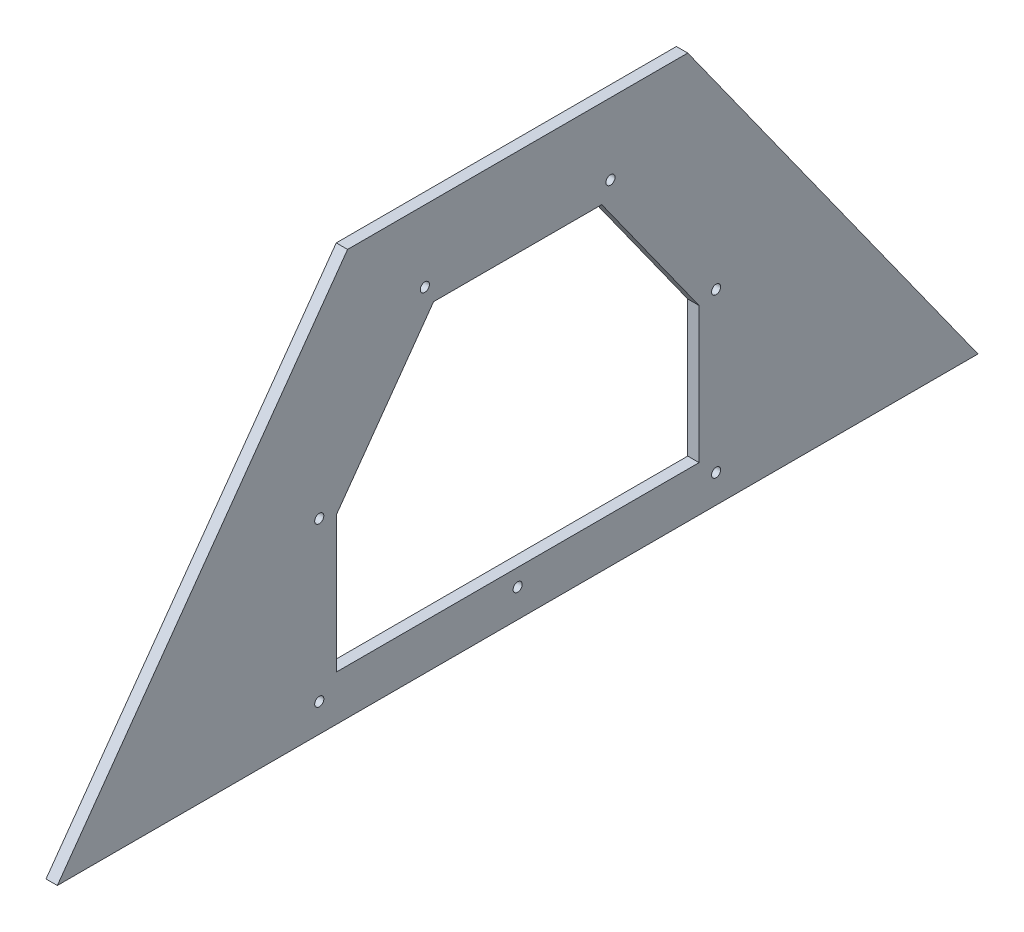
ISO-10303-21;
HEADER;
FILE_DESCRIPTION(('STEP AP214'),'2;1');
FILE_NAME('part.step','',(''),(''),'','','');
FILE_SCHEMA(('AUTOMOTIVE_DESIGN { 1 0 10303 214 1 1 1 1 }'));
ENDSEC;
DATA;
#1=APPLICATION_CONTEXT('core data for automotive mechanical design processes');
#2=APPLICATION_PROTOCOL_DEFINITION('international standard','automotive_design',2000,#1);
#3=PRODUCT_CONTEXT('',#1,'mechanical');
#4=PRODUCT('Part','Part','',(#3));
#5=PRODUCT_RELATED_PRODUCT_CATEGORY('part','',(#4));
#6=PRODUCT_DEFINITION_FORMATION('','',#4);
#7=PRODUCT_DEFINITION_CONTEXT('part definition',#1,'design');
#8=PRODUCT_DEFINITION('design','',#6,#7);
#9=PRODUCT_DEFINITION_SHAPE('','',#8);
#10=(LENGTH_UNIT() NAMED_UNIT(*) SI_UNIT(.MILLI.,.METRE.));
#11=(NAMED_UNIT(*) PLANE_ANGLE_UNIT() SI_UNIT($,.RADIAN.));
#12=(NAMED_UNIT(*) SI_UNIT($,.STERADIAN.) SOLID_ANGLE_UNIT());
#13=UNCERTAINTY_MEASURE_WITH_UNIT(LENGTH_MEASURE(1.E-05),#10,'distance_accuracy_value','');
#14=(GEOMETRIC_REPRESENTATION_CONTEXT(3) GLOBAL_UNCERTAINTY_ASSIGNED_CONTEXT((#13)) GLOBAL_UNIT_ASSIGNED_CONTEXT((#10,
#11,#12)) REPRESENTATION_CONTEXT('',''));
#15=CARTESIAN_POINT('',(0.,0.,0.));
#16=DIRECTION('',(0.,0.,1.));
#17=DIRECTION('',(1.,0.,0.));
#18=AXIS2_PLACEMENT_3D('',#15,#16,#17);
#19=CARTESIAN_POINT('',(6.35,0.,257.81));
#20=DIRECTION('',(0.,-0.581818181818182,-0.813318881685274));
#21=DIRECTION('',(0.,0.813318881685274,-0.581818181818182));
#22=AXIS2_PLACEMENT_3D('',#19,#20,#21);
#23=PLANE('',#22);
#24=DIRECTION('',(0.,-0.813318881685274,0.581818181818182));
#25=VECTOR('',#24,1.);
#26=CARTESIAN_POINT('',(0.,0.,257.81));
#27=LINE('',#26,#25);
#28=CARTESIAN_POINT('',(0.,227.241295542866,95.25));
#29=VERTEX_POINT('',#28);
#30=CARTESIAN_POINT('',(0.,0.,257.81));
#31=VERTEX_POINT('',#30);
#32=EDGE_CURVE('E160',#29,#31,#27,.T.);
#33=ORIENTED_EDGE('',*,*,#32,.T.);
#34=DIRECTION('',(-1.,0.,0.));
#35=VECTOR('',#34,1.);
#36=CARTESIAN_POINT('',(6.35,0.,257.81));
#37=LINE('',#36,#35);
#38=CARTESIAN_POINT('',(6.35,0.,257.81));
#39=VERTEX_POINT('',#38);
#40=EDGE_CURVE('E11',#39,#31,#37,.T.);
#41=ORIENTED_EDGE('',*,*,#40,.F.);
#42=DIRECTION('',(0.,-0.813318881685274,0.581818181818182));
#43=VECTOR('',#42,1.);
#44=CARTESIAN_POINT('',(6.35,0.,257.81));
#45=LINE('',#44,#43);
#46=CARTESIAN_POINT('',(6.35,227.241295542866,95.25));
#47=VERTEX_POINT('',#46);
#48=EDGE_CURVE('E168',#47,#39,#45,.T.);
#49=ORIENTED_EDGE('',*,*,#48,.F.);
#50=DIRECTION('',(-1.,0.,0.));
#51=VECTOR('',#50,1.);
#52=CARTESIAN_POINT('',(6.35,227.241295542866,95.25));
#53=LINE('',#52,#51);
#54=EDGE_CURVE('E178',#47,#29,#53,.T.);
#55=ORIENTED_EDGE('',*,*,#54,.T.);
#56=EDGE_LOOP('',(#33,#41,#49,#55));
#57=FACE_BOUND('',#56,.T.);
#58=ADVANCED_FACE('F36',(#57),#23,.F.);
#59=CARTESIAN_POINT('',(6.35,0.,-257.81));
#60=DIRECTION('',(0.,1.,0.));
#61=DIRECTION('',(0.,0.,1.));
#62=AXIS2_PLACEMENT_3D('',#59,#60,#61);
#63=PLANE('',#62);
#64=DIRECTION('',(0.,0.,-1.));
#65=VECTOR('',#64,1.);
#66=CARTESIAN_POINT('',(0.,0.,-257.81));
#67=LINE('',#66,#65);
#68=CARTESIAN_POINT('',(0.,0.,-257.81));
#69=VERTEX_POINT('',#68);
#70=EDGE_CURVE('E181',#31,#69,#67,.T.);
#71=ORIENTED_EDGE('',*,*,#70,.T.);
#72=DIRECTION('',(-1.,0.,0.));
#73=VECTOR('',#72,1.);
#74=CARTESIAN_POINT('',(6.35,0.,-257.81));
#75=LINE('',#74,#73);
#76=CARTESIAN_POINT('',(6.35,0.,-257.81));
#77=VERTEX_POINT('',#76);
#78=EDGE_CURVE('E43',#77,#69,#75,.T.);
#79=ORIENTED_EDGE('',*,*,#78,.F.);
#80=DIRECTION('',(0.,0.,-1.));
#81=VECTOR('',#80,1.);
#82=CARTESIAN_POINT('',(6.35,0.,-257.81));
#83=LINE('',#82,#81);
#84=EDGE_CURVE('E171',#39,#77,#83,.T.);
#85=ORIENTED_EDGE('',*,*,#84,.F.);
#86=ORIENTED_EDGE('',*,*,#40,.T.);
#87=EDGE_LOOP('',(#71,#79,#85,#86));
#88=FACE_BOUND('',#87,.T.);
#89=ADVANCED_FACE('F209',(#88),#63,.F.);
#90=CARTESIAN_POINT('',(6.35,0.,-257.81));
#91=DIRECTION('',(0.,-0.581818181818182,0.813318881685274));
#92=DIRECTION('',(0.,-0.813318881685274,-0.581818181818182));
#93=AXIS2_PLACEMENT_3D('',#90,#91,#92);
#94=PLANE('',#93);
#95=DIRECTION('',(0.,0.813318881685274,0.581818181818182));
#96=VECTOR('',#95,1.);
#97=CARTESIAN_POINT('',(0.,0.,-257.81));
#98=LINE('',#97,#96);
#99=CARTESIAN_POINT('',(0.,227.241295542866,-95.25));
#100=VERTEX_POINT('',#99);
#101=EDGE_CURVE('E183',#69,#100,#98,.T.);
#102=ORIENTED_EDGE('',*,*,#101,.T.);
#103=DIRECTION('',(-1.,0.,0.));
#104=VECTOR('',#103,1.);
#105=CARTESIAN_POINT('',(6.35,227.241295542866,-95.25));
#106=LINE('',#105,#104);
#107=CARTESIAN_POINT('',(6.35,227.241295542866,-95.25));
#108=VERTEX_POINT('',#107);
#109=EDGE_CURVE('E188',#108,#100,#106,.T.);
#110=ORIENTED_EDGE('',*,*,#109,.F.);
#111=DIRECTION('',(0.,0.813318881685274,0.581818181818182));
#112=VECTOR('',#111,1.);
#113=CARTESIAN_POINT('',(6.35,0.,-257.81));
#114=LINE('',#113,#112);
#115=EDGE_CURVE('E174',#77,#108,#114,.T.);
#116=ORIENTED_EDGE('',*,*,#115,.F.);
#117=ORIENTED_EDGE('',*,*,#78,.T.);
#118=EDGE_LOOP('',(#102,#110,#116,#117));
#119=FACE_BOUND('',#118,.T.);
#120=ADVANCED_FACE('F195',(#119),#94,.F.);
#121=CARTESIAN_POINT('',(6.35,227.241295542866,95.25));
#122=DIRECTION('',(0.,-1.,0.));
#123=DIRECTION('',(0.,0.,-1.));
#124=AXIS2_PLACEMENT_3D('',#121,#122,#123);
#125=PLANE('',#124);
#126=DIRECTION('',(0.,0.,1.));
#127=VECTOR('',#126,1.);
#128=CARTESIAN_POINT('',(0.,227.241295542866,95.25));
#129=LINE('',#128,#127);
#130=EDGE_CURVE('E172',#100,#29,#129,.T.);
#131=ORIENTED_EDGE('',*,*,#130,.T.);
#132=ORIENTED_EDGE('',*,*,#54,.F.);
#133=DIRECTION('',(0.,0.,1.));
#134=VECTOR('',#133,1.);
#135=CARTESIAN_POINT('',(6.35,227.241295542866,95.25));
#136=LINE('',#135,#134);
#137=EDGE_CURVE('E176',#108,#47,#136,.T.);
#138=ORIENTED_EDGE('',*,*,#137,.F.);
#139=ORIENTED_EDGE('',*,*,#109,.T.);
#140=EDGE_LOOP('',(#131,#132,#138,#139));
#141=FACE_BOUND('',#140,.T.);
#142=ADVANCED_FACE('F202',(#141),#125,.F.);
#143=CARTESIAN_POINT('',(6.35,0.,0.));
#144=DIRECTION('',(1.,0.,0.));
#145=DIRECTION('',(0.,0.,-1.));
#146=AXIS2_PLACEMENT_3D('',#143,#144,#145);
#147=PLANE('',#146);
#148=CARTESIAN_POINT('',(6.35,187.325,-51.9867861117994));
#149=DIRECTION('',(1.,0.,0.));
#150=DIRECTION('',(0.,0.,-1.));
#151=AXIS2_PLACEMENT_3D('',#148,#149,#150);
#152=CIRCLE('',#151,2.55269999999999);
#153=CARTESIAN_POINT('',(6.35,187.325,-54.5394861117994));
#154=VERTEX_POINT('',#153);
#155=EDGE_CURVE('E279',#154,#154,#152,.T.);
#156=ORIENTED_EDGE('',*,*,#155,.F.);
#157=EDGE_LOOP('',(#156));
#158=FACE_BOUND('',#157,.T.);
#159=CARTESIAN_POINT('',(6.35,187.325,51.9867861117994));
#160=DIRECTION('',(1.,0.,0.));
#161=DIRECTION('',(0.,0.,-1.));
#162=AXIS2_PLACEMENT_3D('',#159,#160,#161);
#163=CIRCLE('',#162,2.55269999999999);
#164=CARTESIAN_POINT('',(6.35,187.325,49.4340861117994));
#165=VERTEX_POINT('',#164);
#166=EDGE_CURVE('E281',#165,#165,#163,.T.);
#167=ORIENTED_EDGE('',*,*,#166,.F.);
#168=EDGE_LOOP('',(#167));
#169=FACE_BOUND('',#168,.T.);
#170=CARTESIAN_POINT('',(6.35,104.656174089285,-111.125));
#171=DIRECTION('',(1.,0.,0.));
#172=DIRECTION('',(0.,0.,-1.));
#173=AXIS2_PLACEMENT_3D('',#170,#171,#172);
#174=CIRCLE('',#173,2.55270000000001);
#175=CARTESIAN_POINT('',(6.35,104.656174089285,-113.6777));
#176=VERTEX_POINT('',#175);
#177=EDGE_CURVE('E289',#176,#176,#174,.T.);
#178=ORIENTED_EDGE('',*,*,#177,.F.);
#179=EDGE_LOOP('',(#178));
#180=FACE_BOUND('',#179,.T.);
#181=CARTESIAN_POINT('',(6.35,15.8749999999999,-111.125));
#182=DIRECTION('',(1.,0.,0.));
#183=DIRECTION('',(0.,0.,-1.));
#184=AXIS2_PLACEMENT_3D('',#181,#182,#183);
#185=CIRCLE('',#184,2.5527);
#186=CARTESIAN_POINT('',(6.35,15.8749999999999,-113.6777));
#187=VERTEX_POINT('',#186);
#188=EDGE_CURVE('E295',#187,#187,#185,.T.);
#189=ORIENTED_EDGE('',*,*,#188,.F.);
#190=EDGE_LOOP('',(#189));
#191=FACE_BOUND('',#190,.T.);
#192=CARTESIAN_POINT('',(6.35,15.8749999999999,111.125));
#193=DIRECTION('',(1.,0.,0.));
#194=DIRECTION('',(0.,0.,-1.));
#195=AXIS2_PLACEMENT_3D('',#192,#193,#194);
#196=CIRCLE('',#195,2.5527);
#197=CARTESIAN_POINT('',(6.35,15.8749999999999,108.5723));
#198=VERTEX_POINT('',#197);
#199=EDGE_CURVE('E301',#198,#198,#196,.T.);
#200=ORIENTED_EDGE('',*,*,#199,.F.);
#201=EDGE_LOOP('',(#200));
#202=FACE_BOUND('',#201,.T.);
#203=CARTESIAN_POINT('',(6.35,104.656174089285,111.125));
#204=DIRECTION('',(1.,0.,0.));
#205=DIRECTION('',(0.,0.,-1.));
#206=AXIS2_PLACEMENT_3D('',#203,#204,#205);
#207=CIRCLE('',#206,2.55270000000001);
#208=CARTESIAN_POINT('',(6.35,104.656174089285,108.5723));
#209=VERTEX_POINT('',#208);
#210=EDGE_CURVE('E307',#209,#209,#207,.T.);
#211=ORIENTED_EDGE('',*,*,#210,.F.);
#212=EDGE_LOOP('',(#211));
#213=FACE_BOUND('',#212,.T.);
#214=CARTESIAN_POINT('',(6.35,15.8749999999999,0.));
#215=DIRECTION('',(1.,0.,0.));
#216=DIRECTION('',(0.,0.,-1.));
#217=AXIS2_PLACEMENT_3D('',#214,#215,#216);
#218=CIRCLE('',#217,2.5527);
#219=CARTESIAN_POINT('',(6.35,15.8749999999999,-2.55270000000001));
#220=VERTEX_POINT('',#219);
#221=EDGE_CURVE('E312',#220,#220,#218,.T.);
#222=ORIENTED_EDGE('',*,*,#221,.F.);
#223=EDGE_LOOP('',(#222));
#224=FACE_BOUND('',#223,.T.);
#225=DIRECTION('',(0.,1.,0.));
#226=VECTOR('',#225,1.);
#227=CARTESIAN_POINT('',(6.35,101.6,-101.6));
#228=LINE('',#227,#226);
#229=CARTESIAN_POINT('',(6.35,25.3999999999999,-101.6));
#230=VERTEX_POINT('',#229);
#231=CARTESIAN_POINT('',(6.35,101.6,-101.6));
#232=VERTEX_POINT('',#231);
#233=EDGE_CURVE('E50',#230,#232,#228,.T.);
#234=ORIENTED_EDGE('',*,*,#233,.F.);
#235=DIRECTION('',(0.,0.,-1.));
#236=VECTOR('',#235,1.);
#237=CARTESIAN_POINT('',(6.35,25.3999999999999,101.6));
#238=LINE('',#237,#236);
#239=CARTESIAN_POINT('',(6.35,25.3999999999999,101.6));
#240=VERTEX_POINT('',#239);
#241=EDGE_CURVE('E131',#240,#230,#238,.T.);
#242=ORIENTED_EDGE('',*,*,#241,.F.);
#243=DIRECTION('',(0.,-1.,0.));
#244=VECTOR('',#243,1.);
#245=CARTESIAN_POINT('',(6.35,101.6,101.6));
#246=LINE('',#245,#244);
#247=CARTESIAN_POINT('',(6.35,101.6,101.6));
#248=VERTEX_POINT('',#247);
#249=EDGE_CURVE('E134',#248,#240,#246,.T.);
#250=ORIENTED_EDGE('',*,*,#249,.F.);
#251=DIRECTION('',(0.,-0.813318881685274,0.581818181818182));
#252=VECTOR('',#251,1.);
#253=CARTESIAN_POINT('',(6.35,101.6,101.6));
#254=LINE('',#253,#252);
#255=CARTESIAN_POINT('',(6.35,177.8,47.0893443975135));
#256=VERTEX_POINT('',#255);
#257=EDGE_CURVE('E153',#256,#248,#254,.T.);
#258=ORIENTED_EDGE('',*,*,#257,.F.);
#259=DIRECTION('',(0.,0.,1.));
#260=VECTOR('',#259,1.);
#261=CARTESIAN_POINT('',(6.35,177.8,47.0893443975135));
#262=LINE('',#261,#260);
#263=CARTESIAN_POINT('',(6.35,177.8,-47.0893443975135));
#264=VERTEX_POINT('',#263);
#265=EDGE_CURVE('E150',#264,#256,#262,.T.);
#266=ORIENTED_EDGE('',*,*,#265,.F.);
#267=DIRECTION('',(0.,0.813318881685274,0.581818181818182));
#268=VECTOR('',#267,1.);
#269=CARTESIAN_POINT('',(6.35,177.8,-47.0893443975135));
#270=LINE('',#269,#268);
#271=EDGE_CURVE('E148',#232,#264,#270,.T.);
#272=ORIENTED_EDGE('',*,*,#271,.F.);
#273=EDGE_LOOP('',(#234,#242,#250,#258,#266,#272));
#274=FACE_BOUND('',#273,.T.);
#275=ORIENTED_EDGE('',*,*,#48,.T.);
#276=ORIENTED_EDGE('',*,*,#84,.T.);
#277=ORIENTED_EDGE('',*,*,#115,.T.);
#278=ORIENTED_EDGE('',*,*,#137,.T.);
#279=EDGE_LOOP('',(#275,#276,#277,#278));
#280=FACE_BOUND('',#279,.T.);
#281=ADVANCED_FACE('F208',(#158,#169,#180,#191,#202,#213,#224,#274,#280),#147,.T.);
#282=CARTESIAN_POINT('',(0.,0.,0.));
#283=DIRECTION('',(1.,0.,0.));
#284=DIRECTION('',(0.,0.,-1.));
#285=AXIS2_PLACEMENT_3D('',#282,#283,#284);
#286=PLANE('',#285);
#287=CARTESIAN_POINT('',(0.,187.325,-51.9867861117994));
#288=DIRECTION('',(1.,0.,0.));
#289=DIRECTION('',(0.,0.,-1.));
#290=AXIS2_PLACEMENT_3D('',#287,#288,#289);
#291=CIRCLE('',#290,2.55269999999999);
#292=CARTESIAN_POINT('',(0.,187.325,-54.5394861117994));
#293=VERTEX_POINT('',#292);
#294=EDGE_CURVE('E276',#293,#293,#291,.T.);
#295=ORIENTED_EDGE('',*,*,#294,.T.);
#296=EDGE_LOOP('',(#295));
#297=FACE_BOUND('',#296,.T.);
#298=CARTESIAN_POINT('',(0.,187.325,51.9867861117994));
#299=DIRECTION('',(1.,0.,0.));
#300=DIRECTION('',(0.,0.,-1.));
#301=AXIS2_PLACEMENT_3D('',#298,#299,#300);
#302=CIRCLE('',#301,2.55269999999999);
#303=CARTESIAN_POINT('',(0.,187.325,49.4340861117994));
#304=VERTEX_POINT('',#303);
#305=EDGE_CURVE('E286',#304,#304,#302,.T.);
#306=ORIENTED_EDGE('',*,*,#305,.T.);
#307=EDGE_LOOP('',(#306));
#308=FACE_BOUND('',#307,.T.);
#309=CARTESIAN_POINT('',(0.,104.656174089285,-111.125));
#310=DIRECTION('',(1.,0.,0.));
#311=DIRECTION('',(0.,0.,-1.));
#312=AXIS2_PLACEMENT_3D('',#309,#310,#311);
#313=CIRCLE('',#312,2.55270000000001);
#314=CARTESIAN_POINT('',(0.,104.656174089285,-113.6777));
#315=VERTEX_POINT('',#314);
#316=EDGE_CURVE('E292',#315,#315,#313,.T.);
#317=ORIENTED_EDGE('',*,*,#316,.T.);
#318=EDGE_LOOP('',(#317));
#319=FACE_BOUND('',#318,.T.);
#320=CARTESIAN_POINT('',(0.,15.8749999999999,-111.125));
#321=DIRECTION('',(1.,0.,0.));
#322=DIRECTION('',(0.,0.,-1.));
#323=AXIS2_PLACEMENT_3D('',#320,#321,#322);
#324=CIRCLE('',#323,2.5527);
#325=CARTESIAN_POINT('',(0.,15.8749999999999,-113.6777));
#326=VERTEX_POINT('',#325);
#327=EDGE_CURVE('E298',#326,#326,#324,.T.);
#328=ORIENTED_EDGE('',*,*,#327,.T.);
#329=EDGE_LOOP('',(#328));
#330=FACE_BOUND('',#329,.T.);
#331=CARTESIAN_POINT('',(0.,15.8749999999999,111.125));
#332=DIRECTION('',(1.,0.,0.));
#333=DIRECTION('',(0.,0.,-1.));
#334=AXIS2_PLACEMENT_3D('',#331,#332,#333);
#335=CIRCLE('',#334,2.5527);
#336=CARTESIAN_POINT('',(0.,15.8749999999999,108.5723));
#337=VERTEX_POINT('',#336);
#338=EDGE_CURVE('E304',#337,#337,#335,.T.);
#339=ORIENTED_EDGE('',*,*,#338,.T.);
#340=EDGE_LOOP('',(#339));
#341=FACE_BOUND('',#340,.T.);
#342=CARTESIAN_POINT('',(0.,104.656174089285,111.125));
#343=DIRECTION('',(1.,0.,0.));
#344=DIRECTION('',(0.,0.,-1.));
#345=AXIS2_PLACEMENT_3D('',#342,#343,#344);
#346=CIRCLE('',#345,2.55270000000001);
#347=CARTESIAN_POINT('',(0.,104.656174089285,108.5723));
#348=VERTEX_POINT('',#347);
#349=EDGE_CURVE('E310',#348,#348,#346,.T.);
#350=ORIENTED_EDGE('',*,*,#349,.T.);
#351=EDGE_LOOP('',(#350));
#352=FACE_BOUND('',#351,.T.);
#353=CARTESIAN_POINT('',(0.,15.8749999999999,0.));
#354=DIRECTION('',(1.,0.,0.));
#355=DIRECTION('',(0.,0.,-1.));
#356=AXIS2_PLACEMENT_3D('',#353,#354,#355);
#357=CIRCLE('',#356,2.5527);
#358=CARTESIAN_POINT('',(0.,15.8749999999999,-2.55270000000001));
#359=VERTEX_POINT('',#358);
#360=EDGE_CURVE('E137',#359,#359,#357,.T.);
#361=ORIENTED_EDGE('',*,*,#360,.T.);
#362=EDGE_LOOP('',(#361));
#363=FACE_BOUND('',#362,.T.);
#364=DIRECTION('',(0.,0.,-1.));
#365=VECTOR('',#364,1.);
#366=CARTESIAN_POINT('',(0.,25.3999999999999,101.6));
#367=LINE('',#366,#365);
#368=CARTESIAN_POINT('',(0.,25.3999999999999,101.6));
#369=VERTEX_POINT('',#368);
#370=CARTESIAN_POINT('',(0.,25.3999999999999,-101.6));
#371=VERTEX_POINT('',#370);
#372=EDGE_CURVE('E120',#369,#371,#367,.T.);
#373=ORIENTED_EDGE('',*,*,#372,.T.);
#374=DIRECTION('',(0.,1.,0.));
#375=VECTOR('',#374,1.);
#376=CARTESIAN_POINT('',(0.,101.6,-101.6));
#377=LINE('',#376,#375);
#378=CARTESIAN_POINT('',(0.,101.6,-101.6));
#379=VERTEX_POINT('',#378);
#380=EDGE_CURVE('E114',#371,#379,#377,.T.);
#381=ORIENTED_EDGE('',*,*,#380,.T.);
#382=DIRECTION('',(0.,0.813318881685274,0.581818181818182));
#383=VECTOR('',#382,1.);
#384=CARTESIAN_POINT('',(0.,177.8,-47.0893443975135));
#385=LINE('',#384,#383);
#386=CARTESIAN_POINT('',(0.,177.8,-47.0893443975135));
#387=VERTEX_POINT('',#386);
#388=EDGE_CURVE('E123',#379,#387,#385,.T.);
#389=ORIENTED_EDGE('',*,*,#388,.T.);
#390=DIRECTION('',(0.,0.,1.));
#391=VECTOR('',#390,1.);
#392=CARTESIAN_POINT('',(0.,177.8,47.0893443975135));
#393=LINE('',#392,#391);
#394=CARTESIAN_POINT('',(0.,177.8,47.0893443975135));
#395=VERTEX_POINT('',#394);
#396=EDGE_CURVE('E58',#387,#395,#393,.T.);
#397=ORIENTED_EDGE('',*,*,#396,.T.);
#398=DIRECTION('',(0.,-0.813318881685274,0.581818181818182));
#399=VECTOR('',#398,1.);
#400=CARTESIAN_POINT('',(0.,101.6,101.6));
#401=LINE('',#400,#399);
#402=CARTESIAN_POINT('',(0.,101.6,101.6));
#403=VERTEX_POINT('',#402);
#404=EDGE_CURVE('E141',#395,#403,#401,.T.);
#405=ORIENTED_EDGE('',*,*,#404,.T.);
#406=DIRECTION('',(0.,-1.,0.));
#407=VECTOR('',#406,1.);
#408=CARTESIAN_POINT('',(0.,101.6,101.6));
#409=LINE('',#408,#407);
#410=EDGE_CURVE('E144',#403,#369,#409,.T.);
#411=ORIENTED_EDGE('',*,*,#410,.T.);
#412=EDGE_LOOP('',(#373,#381,#389,#397,#405,#411));
#413=FACE_BOUND('',#412,.T.);
#414=ORIENTED_EDGE('',*,*,#32,.F.);
#415=ORIENTED_EDGE('',*,*,#130,.F.);
#416=ORIENTED_EDGE('',*,*,#101,.F.);
#417=ORIENTED_EDGE('',*,*,#70,.F.);
#418=EDGE_LOOP('',(#414,#415,#416,#417));
#419=FACE_BOUND('',#418,.T.);
#420=ADVANCED_FACE('F127',(#297,#308,#319,#330,#341,#352,#363,#413,#419),#286,.F.);
#421=CARTESIAN_POINT('',(0.,101.6,-101.6));
#422=DIRECTION('',(0.,0.,-1.));
#423=DIRECTION('',(0.,1.,0.));
#424=AXIS2_PLACEMENT_3D('',#421,#422,#423);
#425=PLANE('',#424);
#426=ORIENTED_EDGE('',*,*,#233,.T.);
#427=DIRECTION('',(1.,0.,0.));
#428=VECTOR('',#427,1.);
#429=CARTESIAN_POINT('',(0.,101.6,-101.6));
#430=LINE('',#429,#428);
#431=EDGE_CURVE('E110',#379,#232,#430,.T.);
#432=ORIENTED_EDGE('',*,*,#431,.F.);
#433=ORIENTED_EDGE('',*,*,#380,.F.);
#434=DIRECTION('',(1.,0.,0.));
#435=VECTOR('',#434,1.);
#436=CARTESIAN_POINT('',(0.,25.3999999999999,-101.6));
#437=LINE('',#436,#435);
#438=EDGE_CURVE('E158',#371,#230,#437,.T.);
#439=ORIENTED_EDGE('',*,*,#438,.T.);
#440=EDGE_LOOP('',(#426,#432,#433,#439));
#441=FACE_BOUND('',#440,.T.);
#442=ADVANCED_FACE('F112',(#441),#425,.F.);
#443=CARTESIAN_POINT('',(0.,25.3999999999999,101.6));
#444=DIRECTION('',(0.,-1.,0.));
#445=DIRECTION('',(0.,0.,-1.));
#446=AXIS2_PLACEMENT_3D('',#443,#444,#445);
#447=PLANE('',#446);
#448=ORIENTED_EDGE('',*,*,#241,.T.);
#449=ORIENTED_EDGE('',*,*,#438,.F.);
#450=ORIENTED_EDGE('',*,*,#372,.F.);
#451=DIRECTION('',(1.,0.,0.));
#452=VECTOR('',#451,1.);
#453=CARTESIAN_POINT('',(0.,25.3999999999999,101.6));
#454=LINE('',#453,#452);
#455=EDGE_CURVE('E161',#369,#240,#454,.T.);
#456=ORIENTED_EDGE('',*,*,#455,.T.);
#457=EDGE_LOOP('',(#448,#449,#450,#456));
#458=FACE_BOUND('',#457,.T.);
#459=ADVANCED_FACE('F227',(#458),#447,.F.);
#460=CARTESIAN_POINT('',(0.,101.6,101.6));
#461=DIRECTION('',(0.,0.,1.));
#462=DIRECTION('',(0.,-1.,0.));
#463=AXIS2_PLACEMENT_3D('',#460,#461,#462);
#464=PLANE('',#463);
#465=ORIENTED_EDGE('',*,*,#249,.T.);
#466=ORIENTED_EDGE('',*,*,#455,.F.);
#467=ORIENTED_EDGE('',*,*,#410,.F.);
#468=DIRECTION('',(1.,0.,0.));
#469=VECTOR('',#468,1.);
#470=CARTESIAN_POINT('',(0.,101.6,101.6));
#471=LINE('',#470,#469);
#472=EDGE_CURVE('E163',#403,#248,#471,.T.);
#473=ORIENTED_EDGE('',*,*,#472,.T.);
#474=EDGE_LOOP('',(#465,#466,#467,#473));
#475=FACE_BOUND('',#474,.T.);
#476=ADVANCED_FACE('F237',(#475),#464,.F.);
#477=CARTESIAN_POINT('',(0.,101.6,101.6));
#478=DIRECTION('',(0.,0.581818181818182,0.813318881685274));
#479=DIRECTION('',(0.,-0.813318881685274,0.581818181818182));
#480=AXIS2_PLACEMENT_3D('',#477,#478,#479);
#481=PLANE('',#480);
#482=ORIENTED_EDGE('',*,*,#257,.T.);
#483=ORIENTED_EDGE('',*,*,#472,.F.);
#484=ORIENTED_EDGE('',*,*,#404,.F.);
#485=DIRECTION('',(1.,0.,0.));
#486=VECTOR('',#485,1.);
#487=CARTESIAN_POINT('',(0.,177.8,47.0893443975135));
#488=LINE('',#487,#486);
#489=EDGE_CURVE('E165',#395,#256,#488,.T.);
#490=ORIENTED_EDGE('',*,*,#489,.T.);
#491=EDGE_LOOP('',(#482,#483,#484,#490));
#492=FACE_BOUND('',#491,.T.);
#493=ADVANCED_FACE('F234',(#492),#481,.F.);
#494=CARTESIAN_POINT('',(0.,177.8,47.0893443975135));
#495=DIRECTION('',(0.,1.,0.));
#496=DIRECTION('',(0.,0.,1.));
#497=AXIS2_PLACEMENT_3D('',#494,#495,#496);
#498=PLANE('',#497);
#499=ORIENTED_EDGE('',*,*,#265,.T.);
#500=ORIENTED_EDGE('',*,*,#489,.F.);
#501=ORIENTED_EDGE('',*,*,#396,.F.);
#502=DIRECTION('',(1.,0.,0.));
#503=VECTOR('',#502,1.);
#504=CARTESIAN_POINT('',(0.,177.8,-47.0893443975135));
#505=LINE('',#504,#503);
#506=EDGE_CURVE('E119',#387,#264,#505,.T.);
#507=ORIENTED_EDGE('',*,*,#506,.T.);
#508=EDGE_LOOP('',(#499,#500,#501,#507));
#509=FACE_BOUND('',#508,.T.);
#510=ADVANCED_FACE('F231',(#509),#498,.F.);
#511=CARTESIAN_POINT('',(0.,177.8,-47.0893443975135));
#512=DIRECTION('',(0.,0.581818181818182,-0.813318881685274));
#513=DIRECTION('',(0.,0.813318881685274,0.581818181818182));
#514=AXIS2_PLACEMENT_3D('',#511,#512,#513);
#515=PLANE('',#514);
#516=ORIENTED_EDGE('',*,*,#271,.T.);
#517=ORIENTED_EDGE('',*,*,#506,.F.);
#518=ORIENTED_EDGE('',*,*,#388,.F.);
#519=ORIENTED_EDGE('',*,*,#431,.T.);
#520=EDGE_LOOP('',(#516,#517,#518,#519));
#521=FACE_BOUND('',#520,.T.);
#522=ADVANCED_FACE('F124',(#521),#515,.F.);
#523=CARTESIAN_POINT('',(6.35,15.8749999999999,0.));
#524=DIRECTION('',(1.,0.,0.));
#525=DIRECTION('',(0.,0.,-1.));
#526=AXIS2_PLACEMENT_3D('',#523,#524,#525);
#527=CYLINDRICAL_SURFACE('',#526,2.5527);
#528=ORIENTED_EDGE('',*,*,#360,.F.);
#529=EDGE_LOOP('',(#528));
#530=FACE_BOUND('',#529,.T.);
#531=ORIENTED_EDGE('',*,*,#221,.T.);
#532=EDGE_LOOP('',(#531));
#533=FACE_BOUND('',#532,.T.);
#534=ADVANCED_FACE('F230',(#530,#533),#527,.F.);
#535=CARTESIAN_POINT('',(6.35,104.656174089285,111.125));
#536=DIRECTION('',(1.,0.,0.));
#537=DIRECTION('',(0.,0.,-1.));
#538=AXIS2_PLACEMENT_3D('',#535,#536,#537);
#539=CYLINDRICAL_SURFACE('',#538,2.55270000000001);
#540=ORIENTED_EDGE('',*,*,#349,.F.);
#541=EDGE_LOOP('',(#540));
#542=FACE_BOUND('',#541,.T.);
#543=ORIENTED_EDGE('',*,*,#210,.T.);
#544=EDGE_LOOP('',(#543));
#545=FACE_BOUND('',#544,.T.);
#546=ADVANCED_FACE('F247',(#542,#545),#539,.F.);
#547=CARTESIAN_POINT('',(6.35,15.8749999999999,111.125));
#548=DIRECTION('',(1.,0.,0.));
#549=DIRECTION('',(0.,0.,-1.));
#550=AXIS2_PLACEMENT_3D('',#547,#548,#549);
#551=CYLINDRICAL_SURFACE('',#550,2.5527);
#552=ORIENTED_EDGE('',*,*,#338,.F.);
#553=EDGE_LOOP('',(#552));
#554=FACE_BOUND('',#553,.T.);
#555=ORIENTED_EDGE('',*,*,#199,.T.);
#556=EDGE_LOOP('',(#555));
#557=FACE_BOUND('',#556,.T.);
#558=ADVANCED_FACE('F251',(#554,#557),#551,.F.);
#559=CARTESIAN_POINT('',(6.35,15.8749999999999,-111.125));
#560=DIRECTION('',(1.,0.,0.));
#561=DIRECTION('',(0.,0.,-1.));
#562=AXIS2_PLACEMENT_3D('',#559,#560,#561);
#563=CYLINDRICAL_SURFACE('',#562,2.5527);
#564=ORIENTED_EDGE('',*,*,#327,.F.);
#565=EDGE_LOOP('',(#564));
#566=FACE_BOUND('',#565,.T.);
#567=ORIENTED_EDGE('',*,*,#188,.T.);
#568=EDGE_LOOP('',(#567));
#569=FACE_BOUND('',#568,.T.);
#570=ADVANCED_FACE('F255',(#566,#569),#563,.F.);
#571=CARTESIAN_POINT('',(6.35,104.656174089285,-111.125));
#572=DIRECTION('',(1.,0.,0.));
#573=DIRECTION('',(0.,0.,-1.));
#574=AXIS2_PLACEMENT_3D('',#571,#572,#573);
#575=CYLINDRICAL_SURFACE('',#574,2.55270000000001);
#576=ORIENTED_EDGE('',*,*,#316,.F.);
#577=EDGE_LOOP('',(#576));
#578=FACE_BOUND('',#577,.T.);
#579=ORIENTED_EDGE('',*,*,#177,.T.);
#580=EDGE_LOOP('',(#579));
#581=FACE_BOUND('',#580,.T.);
#582=ADVANCED_FACE('F259',(#578,#581),#575,.F.);
#583=CARTESIAN_POINT('',(6.35,187.325,51.9867861117994));
#584=DIRECTION('',(1.,0.,0.));
#585=DIRECTION('',(0.,0.,-1.));
#586=AXIS2_PLACEMENT_3D('',#583,#584,#585);
#587=CYLINDRICAL_SURFACE('',#586,2.55269999999999);
#588=ORIENTED_EDGE('',*,*,#305,.F.);
#589=EDGE_LOOP('',(#588));
#590=FACE_BOUND('',#589,.T.);
#591=ORIENTED_EDGE('',*,*,#166,.T.);
#592=EDGE_LOOP('',(#591));
#593=FACE_BOUND('',#592,.T.);
#594=ADVANCED_FACE('F263',(#590,#593),#587,.F.);
#595=CARTESIAN_POINT('',(6.35,187.325,-51.9867861117994));
#596=DIRECTION('',(1.,0.,0.));
#597=DIRECTION('',(0.,0.,-1.));
#598=AXIS2_PLACEMENT_3D('',#595,#596,#597);
#599=CYLINDRICAL_SURFACE('',#598,2.55269999999999);
#600=ORIENTED_EDGE('',*,*,#294,.F.);
#601=EDGE_LOOP('',(#600));
#602=FACE_BOUND('',#601,.T.);
#603=ORIENTED_EDGE('',*,*,#155,.T.);
#604=EDGE_LOOP('',(#603));
#605=FACE_BOUND('',#604,.T.);
#606=ADVANCED_FACE('F267',(#602,#605),#599,.F.);
#607=CLOSED_SHELL('',(#58,#89,#120,#142,#281,#420,#442,#459,#476,#493,#510,#522,#534,#546,#558,
#570,#582,#594,#606));
#608=MANIFOLD_SOLID_BREP('B2',#607);
#609=ADVANCED_BREP_SHAPE_REPRESENTATION('',(#18,#608),#14);
#610=SHAPE_DEFINITION_REPRESENTATION(#9,#609);
ENDSEC;
END-ISO-10303-21;
